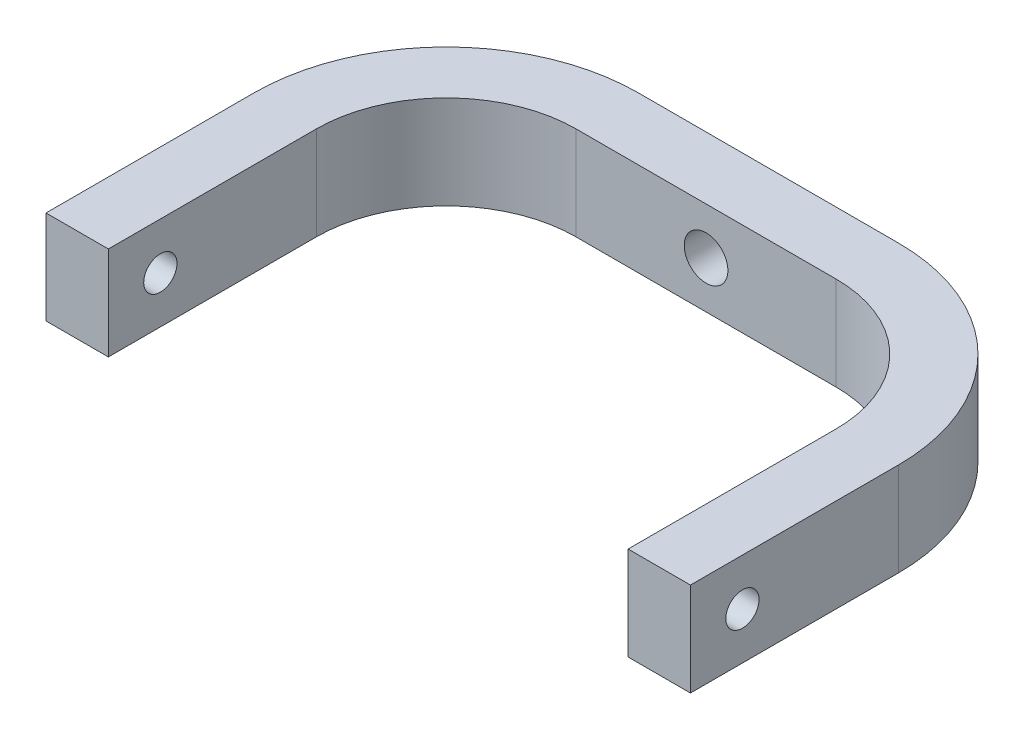
ISO-10303-21;
HEADER;
FILE_DESCRIPTION(('STEP AP214'),'2;1');
FILE_NAME('part.step','',(''),(''),'','','');
FILE_SCHEMA(('AUTOMOTIVE_DESIGN { 1 0 10303 214 1 1 1 1 }'));
ENDSEC;
DATA;
#1=APPLICATION_CONTEXT('core data for automotive mechanical design processes');
#2=APPLICATION_PROTOCOL_DEFINITION('international standard','automotive_design',2000,#1);
#3=PRODUCT_CONTEXT('',#1,'mechanical');
#4=PRODUCT('Part','Part','',(#3));
#5=PRODUCT_RELATED_PRODUCT_CATEGORY('part','',(#4));
#6=PRODUCT_DEFINITION_FORMATION('','',#4);
#7=PRODUCT_DEFINITION_CONTEXT('part definition',#1,'design');
#8=PRODUCT_DEFINITION('design','',#6,#7);
#9=PRODUCT_DEFINITION_SHAPE('','',#8);
#10=(LENGTH_UNIT() NAMED_UNIT(*) SI_UNIT(.MILLI.,.METRE.));
#11=(NAMED_UNIT(*) PLANE_ANGLE_UNIT() SI_UNIT($,.RADIAN.));
#12=(NAMED_UNIT(*) SI_UNIT($,.STERADIAN.) SOLID_ANGLE_UNIT());
#13=UNCERTAINTY_MEASURE_WITH_UNIT(LENGTH_MEASURE(1.E-05),#10,'distance_accuracy_value','');
#14=(GEOMETRIC_REPRESENTATION_CONTEXT(3) GLOBAL_UNCERTAINTY_ASSIGNED_CONTEXT((#13)) GLOBAL_UNIT_ASSIGNED_CONTEXT((#10,
#11,#12)) REPRESENTATION_CONTEXT('',''));
#15=CARTESIAN_POINT('',(0.,0.,0.));
#16=DIRECTION('',(0.,0.,1.));
#17=DIRECTION('',(1.,0.,0.));
#18=AXIS2_PLACEMENT_3D('',#15,#16,#17);
#19=CARTESIAN_POINT('',(-70.0337078651686,18.,-2.07865168539321));
#20=DIRECTION('',(1.,0.,0.));
#21=DIRECTION('',(0.,0.,-1.));
#22=AXIS2_PLACEMENT_3D('',#19,#20,#21);
#23=PLANE('',#22);
#24=CARTESIAN_POINT('',(-70.0337078651686,9.,27.9213483146068));
#25=DIRECTION('',(1.,0.,0.));
#26=DIRECTION('',(0.,0.,-1.));
#27=AXIS2_PLACEMENT_3D('',#24,#25,#26);
#28=CIRCLE('',#27,3.2);
#29=CARTESIAN_POINT('',(-70.0337078651686,9.,24.7213483146068));
#30=VERTEX_POINT('',#29);
#31=EDGE_CURVE('E207',#30,#30,#28,.F.);
#32=ORIENTED_EDGE('',*,*,#31,.F.);
#33=EDGE_LOOP('',(#32));
#34=FACE_BOUND('',#33,.T.);
#35=DIRECTION('',(0.,0.,1.));
#36=VECTOR('',#35,1.);
#37=CARTESIAN_POINT('',(-70.0337078651686,0.,-2.07865168539321));
#38=LINE('',#37,#36);
#39=CARTESIAN_POINT('',(-70.0337078651686,0.,-2.07865168539321));
#40=VERTEX_POINT('',#39);
#41=CARTESIAN_POINT('',(-70.0337078651686,0.,37.9213483146068));
#42=VERTEX_POINT('',#41);
#43=EDGE_CURVE('E154',#40,#42,#38,.T.);
#44=ORIENTED_EDGE('',*,*,#43,.T.);
#45=DIRECTION('',(0.,-1.,0.));
#46=VECTOR('',#45,1.);
#47=CARTESIAN_POINT('',(-70.0337078651686,18.,37.9213483146068));
#48=LINE('',#47,#46);
#49=CARTESIAN_POINT('',(-70.0337078651686,18.,37.9213483146068));
#50=VERTEX_POINT('',#49);
#51=EDGE_CURVE('E11',#50,#42,#48,.T.);
#52=ORIENTED_EDGE('',*,*,#51,.F.);
#53=DIRECTION('',(0.,0.,1.));
#54=VECTOR('',#53,1.);
#55=CARTESIAN_POINT('',(-70.0337078651686,18.,-2.07865168539321));
#56=LINE('',#55,#54);
#57=CARTESIAN_POINT('',(-70.0337078651686,18.,-2.07865168539321));
#58=VERTEX_POINT('',#57);
#59=EDGE_CURVE('E174',#58,#50,#56,.T.);
#60=ORIENTED_EDGE('',*,*,#59,.F.);
#61=DIRECTION('',(0.,-1.,0.));
#62=VECTOR('',#61,1.);
#63=CARTESIAN_POINT('',(-70.0337078651686,18.,-2.07865168539321));
#64=LINE('',#63,#62);
#65=EDGE_CURVE('E153',#58,#40,#64,.T.);
#66=ORIENTED_EDGE('',*,*,#65,.T.);
#67=EDGE_LOOP('',(#44,#52,#60,#66));
#68=FACE_BOUND('',#67,.T.);
#69=ADVANCED_FACE('F45',(#34,#68),#23,.F.);
#70=CARTESIAN_POINT('',(-70.0337078651686,18.,37.9213483146068));
#71=DIRECTION('',(0.,0.,-1.));
#72=DIRECTION('',(-1.,0.,0.));
#73=AXIS2_PLACEMENT_3D('',#70,#71,#72);
#74=PLANE('',#73);
#75=DIRECTION('',(1.,0.,0.));
#76=VECTOR('',#75,1.);
#77=CARTESIAN_POINT('',(-70.0337078651686,0.,37.9213483146068));
#78=LINE('',#77,#76);
#79=CARTESIAN_POINT('',(-58.0337078651686,0.,37.9213483146068));
#80=VERTEX_POINT('',#79);
#81=EDGE_CURVE('E158',#42,#80,#78,.T.);
#82=ORIENTED_EDGE('',*,*,#81,.T.);
#83=DIRECTION('',(0.,-1.,0.));
#84=VECTOR('',#83,1.);
#85=CARTESIAN_POINT('',(-58.0337078651686,18.,37.9213483146068));
#86=LINE('',#85,#84);
#87=CARTESIAN_POINT('',(-58.0337078651686,18.,37.9213483146068));
#88=VERTEX_POINT('',#87);
#89=EDGE_CURVE('E55',#88,#80,#86,.T.);
#90=ORIENTED_EDGE('',*,*,#89,.F.);
#91=DIRECTION('',(1.,0.,0.));
#92=VECTOR('',#91,1.);
#93=CARTESIAN_POINT('',(-70.0337078651686,18.,37.9213483146068));
#94=LINE('',#93,#92);
#95=EDGE_CURVE('E102',#50,#88,#94,.T.);
#96=ORIENTED_EDGE('',*,*,#95,.F.);
#97=ORIENTED_EDGE('',*,*,#51,.T.);
#98=EDGE_LOOP('',(#82,#90,#96,#97));
#99=FACE_BOUND('',#98,.T.);
#100=ADVANCED_FACE('F276',(#99),#74,.F.);
#101=CARTESIAN_POINT('',(-58.0337078651686,18.,37.9213483146068));
#102=DIRECTION('',(-1.,0.,0.));
#103=DIRECTION('',(0.,0.,1.));
#104=AXIS2_PLACEMENT_3D('',#101,#102,#103);
#105=PLANE('',#104);
#106=CARTESIAN_POINT('',(-58.0337078651686,9.,27.9213483146068));
#107=DIRECTION('',(-1.,0.,0.));
#108=DIRECTION('',(0.,0.,1.));
#109=AXIS2_PLACEMENT_3D('',#106,#107,#108);
#110=CIRCLE('',#109,3.2);
#111=CARTESIAN_POINT('',(-58.0337078651686,9.,31.1213483146068));
#112=VERTEX_POINT('',#111);
#113=EDGE_CURVE('E192',#112,#112,#110,.F.);
#114=ORIENTED_EDGE('',*,*,#113,.F.);
#115=EDGE_LOOP('',(#114));
#116=FACE_BOUND('',#115,.T.);
#117=DIRECTION('',(0.,0.,-1.));
#118=VECTOR('',#117,1.);
#119=CARTESIAN_POINT('',(-58.0337078651686,0.,37.9213483146068));
#120=LINE('',#119,#118);
#121=CARTESIAN_POINT('',(-58.0337078651686,0.,-2.07865168539321));
#122=VERTEX_POINT('',#121);
#123=EDGE_CURVE('E162',#80,#122,#120,.T.);
#124=ORIENTED_EDGE('',*,*,#123,.T.);
#125=DIRECTION('',(0.,-1.,0.));
#126=VECTOR('',#125,1.);
#127=CARTESIAN_POINT('',(-58.0337078651686,18.,-2.07865168539321));
#128=LINE('',#127,#126);
#129=CARTESIAN_POINT('',(-58.0337078651686,18.,-2.07865168539321));
#130=VERTEX_POINT('',#129);
#131=EDGE_CURVE('E137',#130,#122,#128,.T.);
#132=ORIENTED_EDGE('',*,*,#131,.F.);
#133=DIRECTION('',(0.,0.,-1.));
#134=VECTOR('',#133,1.);
#135=CARTESIAN_POINT('',(-58.0337078651686,18.,37.9213483146068));
#136=LINE('',#135,#134);
#137=EDGE_CURVE('E122',#88,#130,#136,.T.);
#138=ORIENTED_EDGE('',*,*,#137,.F.);
#139=ORIENTED_EDGE('',*,*,#89,.T.);
#140=EDGE_LOOP('',(#124,#132,#138,#139));
#141=FACE_BOUND('',#140,.T.);
#142=ADVANCED_FACE('F279',(#116,#141),#105,.F.);
#143=CARTESIAN_POINT('',(-33.0337078651686,18.,-2.07865168539322));
#144=DIRECTION('',(0.,-1.,0.));
#145=DIRECTION('',(0.,0.,-1.));
#146=AXIS2_PLACEMENT_3D('',#143,#144,#145);
#147=CYLINDRICAL_SURFACE('',#146,25.);
#148=CARTESIAN_POINT('',(-33.0337078651686,0.,-2.07865168539322));
#149=DIRECTION('',(0.,-1.,0.));
#150=DIRECTION('',(0.,0.,-1.));
#151=AXIS2_PLACEMENT_3D('',#148,#149,#150);
#152=CIRCLE('',#151,25.);
#153=CARTESIAN_POINT('',(-33.0337078651686,0.,-27.0786516853932));
#154=VERTEX_POINT('',#153);
#155=EDGE_CURVE('E132',#122,#154,#152,.T.);
#156=ORIENTED_EDGE('',*,*,#155,.T.);
#157=DIRECTION('',(0.,-1.,0.));
#158=VECTOR('',#157,1.);
#159=CARTESIAN_POINT('',(-33.0337078651686,18.,-27.0786516853932));
#160=LINE('',#159,#158);
#161=CARTESIAN_POINT('',(-33.0337078651686,18.,-27.0786516853932));
#162=VERTEX_POINT('',#161);
#163=EDGE_CURVE('E129',#162,#154,#160,.T.);
#164=ORIENTED_EDGE('',*,*,#163,.F.);
#165=CARTESIAN_POINT('',(-33.0337078651686,18.,-2.07865168539322));
#166=DIRECTION('',(0.,-1.,0.));
#167=DIRECTION('',(0.,0.,-1.));
#168=AXIS2_PLACEMENT_3D('',#165,#166,#167);
#169=CIRCLE('',#168,25.);
#170=EDGE_CURVE('E113',#130,#162,#169,.T.);
#171=ORIENTED_EDGE('',*,*,#170,.F.);
#172=ORIENTED_EDGE('',*,*,#131,.T.);
#173=EDGE_LOOP('',(#156,#164,#171,#172));
#174=FACE_BOUND('',#173,.T.);
#175=ADVANCED_FACE('F130',(#174),#147,.F.);
#176=CARTESIAN_POINT('',(-8.03370786516859,18.,-27.0786516853932));
#177=DIRECTION('',(0.,0.,-1.));
#178=DIRECTION('',(-1.,0.,0.));
#179=AXIS2_PLACEMENT_3D('',#176,#177,#178);
#180=PLANE('',#179);
#181=CARTESIAN_POINT('',(-8.0337078651686,9.,-27.0786516853932));
#182=DIRECTION('',(0.,0.,1.));
#183=DIRECTION('',(1.,0.,0.));
#184=AXIS2_PLACEMENT_3D('',#181,#182,#183);
#185=CIRCLE('',#184,4.2);
#186=CARTESIAN_POINT('',(-3.8337078651686,9.,-27.0786516853932));
#187=VERTEX_POINT('',#186);
#188=EDGE_CURVE('E195',#187,#187,#185,.T.);
#189=ORIENTED_EDGE('',*,*,#188,.F.);
#190=EDGE_LOOP('',(#189));
#191=FACE_BOUND('',#190,.T.);
#192=DIRECTION('',(1.,0.,0.));
#193=VECTOR('',#192,1.);
#194=CARTESIAN_POINT('',(-8.03370786516859,0.,-27.0786516853932));
#195=LINE('',#194,#193);
#196=CARTESIAN_POINT('',(16.9662921348314,0.,-27.0786516853932));
#197=VERTEX_POINT('',#196);
#198=EDGE_CURVE('E167',#154,#197,#195,.T.);
#199=ORIENTED_EDGE('',*,*,#198,.T.);
#200=DIRECTION('',(0.,-1.,0.));
#201=VECTOR('',#200,1.);
#202=CARTESIAN_POINT('',(16.9662921348314,18.,-27.0786516853932));
#203=LINE('',#202,#201);
#204=CARTESIAN_POINT('',(16.9662921348314,18.,-27.0786516853932));
#205=VERTEX_POINT('',#204);
#206=EDGE_CURVE('E142',#205,#197,#203,.T.);
#207=ORIENTED_EDGE('',*,*,#206,.F.);
#208=DIRECTION('',(1.,0.,0.));
#209=VECTOR('',#208,1.);
#210=CARTESIAN_POINT('',(-8.03370786516859,18.,-27.0786516853932));
#211=LINE('',#210,#209);
#212=EDGE_CURVE('E119',#162,#205,#211,.T.);
#213=ORIENTED_EDGE('',*,*,#212,.F.);
#214=ORIENTED_EDGE('',*,*,#163,.T.);
#215=EDGE_LOOP('',(#199,#207,#213,#214));
#216=FACE_BOUND('',#215,.T.);
#217=ADVANCED_FACE('F140',(#191,#216),#180,.F.);
#218=CARTESIAN_POINT('',(-33.0337078651686,18.,-39.0786516853932));
#219=DIRECTION('',(0.,0.,1.));
#220=DIRECTION('',(1.,0.,0.));
#221=AXIS2_PLACEMENT_3D('',#218,#219,#220);
#222=PLANE('',#221);
#223=CARTESIAN_POINT('',(-8.0337078651686,9.,-39.0786516853932));
#224=DIRECTION('',(0.,0.,1.));
#225=DIRECTION('',(1.,0.,0.));
#226=AXIS2_PLACEMENT_3D('',#223,#224,#225);
#227=CIRCLE('',#226,4.2);
#228=CARTESIAN_POINT('',(-3.8337078651686,9.,-39.0786516853932));
#229=VERTEX_POINT('',#228);
#230=EDGE_CURVE('E48',#229,#229,#227,.T.);
#231=ORIENTED_EDGE('',*,*,#230,.T.);
#232=EDGE_LOOP('',(#231));
#233=FACE_BOUND('',#232,.T.);
#234=DIRECTION('',(-1.,0.,0.));
#235=VECTOR('',#234,1.);
#236=CARTESIAN_POINT('',(-33.0337078651686,0.,-39.0786516853932));
#237=LINE('',#236,#235);
#238=CARTESIAN_POINT('',(16.9662921348314,0.,-39.0786516853932));
#239=VERTEX_POINT('',#238);
#240=CARTESIAN_POINT('',(-33.0337078651686,0.,-39.0786516853932));
#241=VERTEX_POINT('',#240);
#242=EDGE_CURVE('E88',#239,#241,#237,.T.);
#243=ORIENTED_EDGE('',*,*,#242,.T.);
#244=DIRECTION('',(0.,-1.,0.));
#245=VECTOR('',#244,1.);
#246=CARTESIAN_POINT('',(-33.0337078651686,18.,-39.0786516853932));
#247=LINE('',#246,#245);
#248=CARTESIAN_POINT('',(-33.0337078651686,18.,-39.0786516853932));
#249=VERTEX_POINT('',#248);
#250=EDGE_CURVE('E138',#249,#241,#247,.T.);
#251=ORIENTED_EDGE('',*,*,#250,.F.);
#252=DIRECTION('',(-1.,0.,0.));
#253=VECTOR('',#252,1.);
#254=CARTESIAN_POINT('',(-33.0337078651686,18.,-39.0786516853932));
#255=LINE('',#254,#253);
#256=CARTESIAN_POINT('',(16.9662921348314,18.,-39.0786516853932));
#257=VERTEX_POINT('',#256);
#258=EDGE_CURVE('E145',#257,#249,#255,.T.);
#259=ORIENTED_EDGE('',*,*,#258,.F.);
#260=DIRECTION('',(0.,-1.,0.));
#261=VECTOR('',#260,1.);
#262=CARTESIAN_POINT('',(16.9662921348314,18.,-39.0786516853932));
#263=LINE('',#262,#261);
#264=EDGE_CURVE('E264',#257,#239,#263,.T.);
#265=ORIENTED_EDGE('',*,*,#264,.T.);
#266=EDGE_LOOP('',(#243,#251,#259,#265));
#267=FACE_BOUND('',#266,.T.);
#268=ADVANCED_FACE('F327',(#233,#267),#222,.F.);
#269=CARTESIAN_POINT('',(-33.0337078651686,18.,-2.07865168539322));
#270=DIRECTION('',(0.,-1.,0.));
#271=DIRECTION('',(0.,0.,-1.));
#272=AXIS2_PLACEMENT_3D('',#269,#270,#271);
#273=CYLINDRICAL_SURFACE('',#272,37.);
#274=CARTESIAN_POINT('',(-33.0337078651686,0.,-2.07865168539322));
#275=DIRECTION('',(0.,1.,0.));
#276=DIRECTION('',(0.,0.,-1.));
#277=AXIS2_PLACEMENT_3D('',#274,#275,#276);
#278=CIRCLE('',#277,37.);
#279=EDGE_CURVE('E94',#241,#40,#278,.T.);
#280=ORIENTED_EDGE('',*,*,#279,.T.);
#281=ORIENTED_EDGE('',*,*,#65,.F.);
#282=CARTESIAN_POINT('',(-33.0337078651686,18.,-2.07865168539322));
#283=DIRECTION('',(0.,1.,0.));
#284=DIRECTION('',(0.,0.,-1.));
#285=AXIS2_PLACEMENT_3D('',#282,#283,#284);
#286=CIRCLE('',#285,37.);
#287=EDGE_CURVE('E64',#249,#58,#286,.T.);
#288=ORIENTED_EDGE('',*,*,#287,.F.);
#289=ORIENTED_EDGE('',*,*,#250,.T.);
#290=EDGE_LOOP('',(#280,#281,#288,#289));
#291=FACE_BOUND('',#290,.T.);
#292=ADVANCED_FACE('F328',(#291),#273,.T.);
#293=CARTESIAN_POINT('',(-33.0337078651686,18.,-2.07865168539322));
#294=DIRECTION('',(0.,-1.,0.));
#295=DIRECTION('',(0.,0.,-1.));
#296=AXIS2_PLACEMENT_3D('',#293,#294,#295);
#297=PLANE('',#296);
#298=ORIENTED_EDGE('',*,*,#59,.T.);
#299=ORIENTED_EDGE('',*,*,#95,.T.);
#300=ORIENTED_EDGE('',*,*,#137,.T.);
#301=ORIENTED_EDGE('',*,*,#170,.T.);
#302=ORIENTED_EDGE('',*,*,#212,.T.);
#303=CARTESIAN_POINT('',(16.9662921348314,18.,-2.07865168539323));
#304=DIRECTION('',(0.,1.,0.));
#305=DIRECTION('',(0.,0.,-1.));
#306=AXIS2_PLACEMENT_3D('',#303,#304,#305);
#307=CIRCLE('',#306,25.);
#308=CARTESIAN_POINT('',(41.9662921348314,18.,-2.07865168539323));
#309=VERTEX_POINT('',#308);
#310=EDGE_CURVE('E221',#309,#205,#307,.T.);
#311=ORIENTED_EDGE('',*,*,#310,.F.);
#312=DIRECTION('',(0.,0.,-1.));
#313=VECTOR('',#312,1.);
#314=CARTESIAN_POINT('',(41.9662921348314,18.,37.9213483146068));
#315=LINE('',#314,#313);
#316=CARTESIAN_POINT('',(41.9662921348314,18.,37.9213483146068));
#317=VERTEX_POINT('',#316);
#318=EDGE_CURVE('E224',#317,#309,#315,.T.);
#319=ORIENTED_EDGE('',*,*,#318,.F.);
#320=DIRECTION('',(-1.,0.,0.));
#321=VECTOR('',#320,1.);
#322=CARTESIAN_POINT('',(53.9662921348314,18.,37.9213483146068));
#323=LINE('',#322,#321);
#324=CARTESIAN_POINT('',(53.9662921348314,18.,37.9213483146068));
#325=VERTEX_POINT('',#324);
#326=EDGE_CURVE('E228',#325,#317,#323,.T.);
#327=ORIENTED_EDGE('',*,*,#326,.F.);
#328=DIRECTION('',(0.,0.,1.));
#329=VECTOR('',#328,1.);
#330=CARTESIAN_POINT('',(53.9662921348314,18.,-2.07865168539323));
#331=LINE('',#330,#329);
#332=CARTESIAN_POINT('',(53.9662921348314,18.,-2.07865168539323));
#333=VERTEX_POINT('',#332);
#334=EDGE_CURVE('E212',#333,#325,#331,.T.);
#335=ORIENTED_EDGE('',*,*,#334,.F.);
#336=CARTESIAN_POINT('',(16.9662921348314,18.,-2.07865168539323));
#337=DIRECTION('',(0.,-1.,0.));
#338=DIRECTION('',(0.,0.,-1.));
#339=AXIS2_PLACEMENT_3D('',#336,#337,#338);
#340=CIRCLE('',#339,37.);
#341=EDGE_CURVE('E216',#257,#333,#340,.T.);
#342=ORIENTED_EDGE('',*,*,#341,.F.);
#343=ORIENTED_EDGE('',*,*,#258,.T.);
#344=ORIENTED_EDGE('',*,*,#287,.T.);
#345=EDGE_LOOP('',(#298,#299,#300,#301,#302,#311,#319,#327,#335,#342,#343,#344));
#346=FACE_BOUND('',#345,.T.);
#347=ADVANCED_FACE('F115',(#346),#297,.F.);
#348=CARTESIAN_POINT('',(-33.0337078651686,0.,-2.07865168539322));
#349=DIRECTION('',(0.,-1.,0.));
#350=DIRECTION('',(0.,0.,-1.));
#351=AXIS2_PLACEMENT_3D('',#348,#349,#350);
#352=PLANE('',#351);
#353=ORIENTED_EDGE('',*,*,#43,.F.);
#354=ORIENTED_EDGE('',*,*,#279,.F.);
#355=ORIENTED_EDGE('',*,*,#242,.F.);
#356=CARTESIAN_POINT('',(16.9662921348314,0.,-2.07865168539323));
#357=DIRECTION('',(0.,-1.,0.));
#358=DIRECTION('',(0.,0.,-1.));
#359=AXIS2_PLACEMENT_3D('',#356,#357,#358);
#360=CIRCLE('',#359,37.);
#361=CARTESIAN_POINT('',(53.9662921348314,0.,-2.07865168539323));
#362=VERTEX_POINT('',#361);
#363=EDGE_CURVE('E236',#239,#362,#360,.T.);
#364=ORIENTED_EDGE('',*,*,#363,.T.);
#365=DIRECTION('',(0.,0.,1.));
#366=VECTOR('',#365,1.);
#367=CARTESIAN_POINT('',(53.9662921348314,0.,-2.07865168539323));
#368=LINE('',#367,#366);
#369=CARTESIAN_POINT('',(53.9662921348314,0.,37.9213483146068));
#370=VERTEX_POINT('',#369);
#371=EDGE_CURVE('E211',#362,#370,#368,.T.);
#372=ORIENTED_EDGE('',*,*,#371,.T.);
#373=DIRECTION('',(-1.,0.,0.));
#374=VECTOR('',#373,1.);
#375=CARTESIAN_POINT('',(53.9662921348314,0.,37.9213483146068));
#376=LINE('',#375,#374);
#377=CARTESIAN_POINT('',(41.9662921348314,0.,37.9213483146068));
#378=VERTEX_POINT('',#377);
#379=EDGE_CURVE('E217',#370,#378,#376,.T.);
#380=ORIENTED_EDGE('',*,*,#379,.T.);
#381=DIRECTION('',(0.,0.,-1.));
#382=VECTOR('',#381,1.);
#383=CARTESIAN_POINT('',(41.9662921348314,0.,37.9213483146068));
#384=LINE('',#383,#382);
#385=CARTESIAN_POINT('',(41.9662921348314,0.,-2.07865168539323));
#386=VERTEX_POINT('',#385);
#387=EDGE_CURVE('E244',#378,#386,#384,.T.);
#388=ORIENTED_EDGE('',*,*,#387,.T.);
#389=CARTESIAN_POINT('',(16.9662921348314,0.,-2.07865168539323));
#390=DIRECTION('',(0.,1.,0.));
#391=DIRECTION('',(0.,0.,-1.));
#392=AXIS2_PLACEMENT_3D('',#389,#390,#391);
#393=CIRCLE('',#392,25.);
#394=EDGE_CURVE('E240',#386,#197,#393,.T.);
#395=ORIENTED_EDGE('',*,*,#394,.T.);
#396=ORIENTED_EDGE('',*,*,#198,.F.);
#397=ORIENTED_EDGE('',*,*,#155,.F.);
#398=ORIENTED_EDGE('',*,*,#123,.F.);
#399=ORIENTED_EDGE('',*,*,#81,.F.);
#400=EDGE_LOOP('',(#353,#354,#355,#364,#372,#380,#388,#395,#396,#397,#398,#399));
#401=FACE_BOUND('',#400,.T.);
#402=ADVANCED_FACE('F282',(#401),#352,.T.);
#403=CARTESIAN_POINT('',(53.9662921348314,18.,-2.07865168539323));
#404=DIRECTION('',(1.,0.,0.));
#405=DIRECTION('',(0.,0.,-1.));
#406=AXIS2_PLACEMENT_3D('',#403,#404,#405);
#407=PLANE('',#406);
#408=CARTESIAN_POINT('',(53.9662921348314,9.,27.9213483146068));
#409=DIRECTION('',(1.,0.,0.));
#410=DIRECTION('',(0.,0.,-1.));
#411=AXIS2_PLACEMENT_3D('',#408,#409,#410);
#412=CIRCLE('',#411,3.2);
#413=CARTESIAN_POINT('',(53.9662921348314,9.,24.7213483146068));
#414=VERTEX_POINT('',#413);
#415=EDGE_CURVE('E186',#414,#414,#412,.F.);
#416=ORIENTED_EDGE('',*,*,#415,.T.);
#417=EDGE_LOOP('',(#416));
#418=FACE_BOUND('',#417,.T.);
#419=ORIENTED_EDGE('',*,*,#371,.F.);
#420=DIRECTION('',(0.,-1.,0.));
#421=VECTOR('',#420,1.);
#422=CARTESIAN_POINT('',(53.9662921348314,18.,-2.07865168539323));
#423=LINE('',#422,#421);
#424=EDGE_CURVE('E159',#333,#362,#423,.T.);
#425=ORIENTED_EDGE('',*,*,#424,.F.);
#426=ORIENTED_EDGE('',*,*,#334,.T.);
#427=DIRECTION('',(0.,-1.,0.));
#428=VECTOR('',#427,1.);
#429=CARTESIAN_POINT('',(53.9662921348314,18.,37.9213483146068));
#430=LINE('',#429,#428);
#431=EDGE_CURVE('E232',#325,#370,#430,.T.);
#432=ORIENTED_EDGE('',*,*,#431,.T.);
#433=EDGE_LOOP('',(#419,#425,#426,#432));
#434=FACE_BOUND('',#433,.T.);
#435=ADVANCED_FACE('F321',(#418,#434),#407,.T.);
#436=CARTESIAN_POINT('',(16.9662921348314,18.,-2.07865168539323));
#437=DIRECTION('',(0.,-1.,0.));
#438=DIRECTION('',(0.,0.,-1.));
#439=AXIS2_PLACEMENT_3D('',#436,#437,#438);
#440=CYLINDRICAL_SURFACE('',#439,37.);
#441=ORIENTED_EDGE('',*,*,#363,.F.);
#442=ORIENTED_EDGE('',*,*,#264,.F.);
#443=ORIENTED_EDGE('',*,*,#341,.T.);
#444=ORIENTED_EDGE('',*,*,#424,.T.);
#445=EDGE_LOOP('',(#441,#442,#443,#444));
#446=FACE_BOUND('',#445,.T.);
#447=ADVANCED_FACE('F326',(#446),#440,.T.);
#448=CARTESIAN_POINT('',(16.9662921348314,18.,-2.07865168539323));
#449=DIRECTION('',(0.,-1.,0.));
#450=DIRECTION('',(0.,0.,-1.));
#451=AXIS2_PLACEMENT_3D('',#448,#449,#450);
#452=CYLINDRICAL_SURFACE('',#451,25.);
#453=ORIENTED_EDGE('',*,*,#394,.F.);
#454=DIRECTION('',(0.,-1.,0.));
#455=VECTOR('',#454,1.);
#456=CARTESIAN_POINT('',(41.9662921348314,18.,-2.07865168539323));
#457=LINE('',#456,#455);
#458=EDGE_CURVE('E258',#309,#386,#457,.T.);
#459=ORIENTED_EDGE('',*,*,#458,.F.);
#460=ORIENTED_EDGE('',*,*,#310,.T.);
#461=ORIENTED_EDGE('',*,*,#206,.T.);
#462=EDGE_LOOP('',(#453,#459,#460,#461));
#463=FACE_BOUND('',#462,.T.);
#464=ADVANCED_FACE('F289',(#463),#452,.F.);
#465=CARTESIAN_POINT('',(41.9662921348314,18.,37.9213483146068));
#466=DIRECTION('',(-1.,0.,0.));
#467=DIRECTION('',(0.,0.,1.));
#468=AXIS2_PLACEMENT_3D('',#465,#466,#467);
#469=PLANE('',#468);
#470=CARTESIAN_POINT('',(41.9662921348314,9.,27.9213483146068));
#471=DIRECTION('',(-1.,0.,0.));
#472=DIRECTION('',(0.,0.,1.));
#473=AXIS2_PLACEMENT_3D('',#470,#471,#472);
#474=CIRCLE('',#473,3.2);
#475=CARTESIAN_POINT('',(41.9662921348314,9.,31.1213483146068));
#476=VERTEX_POINT('',#475);
#477=EDGE_CURVE('E183',#476,#476,#474,.F.);
#478=ORIENTED_EDGE('',*,*,#477,.T.);
#479=EDGE_LOOP('',(#478));
#480=FACE_BOUND('',#479,.T.);
#481=ORIENTED_EDGE('',*,*,#387,.F.);
#482=DIRECTION('',(0.,-1.,0.));
#483=VECTOR('',#482,1.);
#484=CARTESIAN_POINT('',(41.9662921348314,18.,37.9213483146068));
#485=LINE('',#484,#483);
#486=EDGE_CURVE('E254',#317,#378,#485,.T.);
#487=ORIENTED_EDGE('',*,*,#486,.F.);
#488=ORIENTED_EDGE('',*,*,#318,.T.);
#489=ORIENTED_EDGE('',*,*,#458,.T.);
#490=EDGE_LOOP('',(#481,#487,#488,#489));
#491=FACE_BOUND('',#490,.T.);
#492=ADVANCED_FACE('F301',(#480,#491),#469,.T.);
#493=CARTESIAN_POINT('',(53.9662921348314,18.,37.9213483146068));
#494=DIRECTION('',(0.,0.,1.));
#495=DIRECTION('',(1.,0.,0.));
#496=AXIS2_PLACEMENT_3D('',#493,#494,#495);
#497=PLANE('',#496);
#498=ORIENTED_EDGE('',*,*,#379,.F.);
#499=ORIENTED_EDGE('',*,*,#431,.F.);
#500=ORIENTED_EDGE('',*,*,#326,.T.);
#501=ORIENTED_EDGE('',*,*,#486,.T.);
#502=EDGE_LOOP('',(#498,#499,#500,#501));
#503=FACE_BOUND('',#502,.T.);
#504=ADVANCED_FACE('F306',(#503),#497,.T.);
#505=CARTESIAN_POINT('',(91.9662921348314,9.,27.9213483146068));
#506=DIRECTION('',(-1.,0.,0.));
#507=DIRECTION('',(0.,0.,1.));
#508=AXIS2_PLACEMENT_3D('',#505,#506,#507);
#509=CYLINDRICAL_SURFACE('',#508,3.2);
#510=ORIENTED_EDGE('',*,*,#415,.F.);
#511=EDGE_LOOP('',(#510));
#512=FACE_BOUND('',#511,.T.);
#513=ORIENTED_EDGE('',*,*,#477,.F.);
#514=EDGE_LOOP('',(#513));
#515=FACE_BOUND('',#514,.T.);
#516=ADVANCED_FACE('F342',(#512,#515),#509,.F.);
#517=ORIENTED_EDGE('',*,*,#113,.T.);
#518=EDGE_LOOP('',(#517));
#519=FACE_BOUND('',#518,.T.);
#520=ORIENTED_EDGE('',*,*,#31,.T.);
#521=EDGE_LOOP('',(#520));
#522=FACE_BOUND('',#521,.T.);
#523=ADVANCED_FACE('F339',(#519,#522),#509,.F.);
#524=CARTESIAN_POINT('',(-8.0337078651686,9.,-67.0786516853932));
#525=DIRECTION('',(0.,0.,1.));
#526=DIRECTION('',(1.,0.,0.));
#527=AXIS2_PLACEMENT_3D('',#524,#525,#526);
#528=CYLINDRICAL_SURFACE('',#527,4.2);
#529=ORIENTED_EDGE('',*,*,#188,.T.);
#530=EDGE_LOOP('',(#529));
#531=FACE_BOUND('',#530,.T.);
#532=ORIENTED_EDGE('',*,*,#230,.F.);
#533=EDGE_LOOP('',(#532));
#534=FACE_BOUND('',#533,.T.);
#535=ADVANCED_FACE('F341',(#531,#534),#528,.F.);
#536=CLOSED_SHELL('',(#69,#100,#142,#175,#217,#268,#292,#347,#402,#435,#447,#464,#492,#504,#516,
#523,#535));
#537=MANIFOLD_SOLID_BREP('B2',#536);
#538=ADVANCED_BREP_SHAPE_REPRESENTATION('',(#18,#537),#14);
#539=SHAPE_DEFINITION_REPRESENTATION(#9,#538);
ENDSEC;
END-ISO-10303-21;
